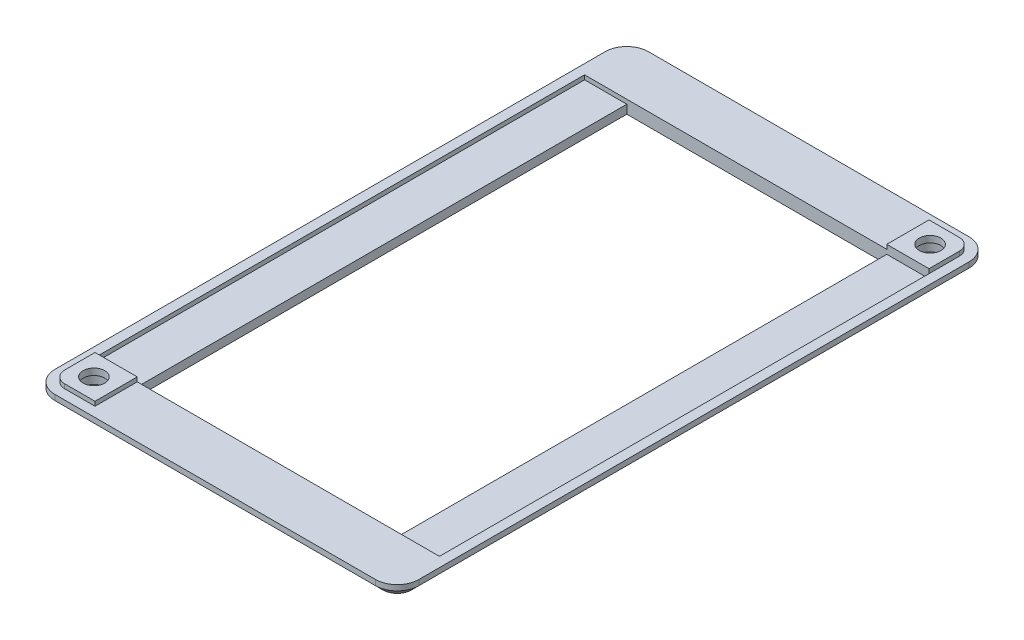
ISO-10303-21;
HEADER;
FILE_DESCRIPTION(('STEP AP214'),'2;1');
FILE_NAME('part.step','',(''),(''),'','','');
FILE_SCHEMA(('AUTOMOTIVE_DESIGN { 1 0 10303 214 1 1 1 1 }'));
ENDSEC;
DATA;
#1=APPLICATION_CONTEXT('core data for automotive mechanical design processes');
#2=APPLICATION_PROTOCOL_DEFINITION('international standard','automotive_design',2000,#1);
#3=PRODUCT_CONTEXT('',#1,'mechanical');
#4=PRODUCT('Part','Part','',(#3));
#5=PRODUCT_RELATED_PRODUCT_CATEGORY('part','',(#4));
#6=PRODUCT_DEFINITION_FORMATION('','',#4);
#7=PRODUCT_DEFINITION_CONTEXT('part definition',#1,'design');
#8=PRODUCT_DEFINITION('design','',#6,#7);
#9=PRODUCT_DEFINITION_SHAPE('','',#8);
#10=(LENGTH_UNIT() NAMED_UNIT(*) SI_UNIT(.MILLI.,.METRE.));
#11=(NAMED_UNIT(*) PLANE_ANGLE_UNIT() SI_UNIT($,.RADIAN.));
#12=(NAMED_UNIT(*) SI_UNIT($,.STERADIAN.) SOLID_ANGLE_UNIT());
#13=UNCERTAINTY_MEASURE_WITH_UNIT(LENGTH_MEASURE(1.E-05),#10,'distance_accuracy_value','');
#14=(GEOMETRIC_REPRESENTATION_CONTEXT(3) GLOBAL_UNCERTAINTY_ASSIGNED_CONTEXT((#13)) GLOBAL_UNIT_ASSIGNED_CONTEXT((#10,
#11,#12)) REPRESENTATION_CONTEXT('',''));
#15=CARTESIAN_POINT('',(0.,0.,0.));
#16=DIRECTION('',(0.,0.,1.));
#17=DIRECTION('',(1.,0.,0.));
#18=AXIS2_PLACEMENT_3D('',#15,#16,#17);
#19=CARTESIAN_POINT('',(0.,3.,0.));
#20=DIRECTION('',(0.,-1.,0.));
#21=DIRECTION('',(0.,0.,-1.));
#22=AXIS2_PLACEMENT_3D('',#19,#20,#21);
#23=PLANE('',#22);
#24=DIRECTION('',(0.,0.,1.));
#25=VECTOR('',#24,1.);
#26=CARTESIAN_POINT('',(2.25,3.,-12.));
#27=LINE('',#26,#25);
#28=CARTESIAN_POINT('',(2.25,3.,-12.));
#29=VERTEX_POINT('',#28);
#30=CARTESIAN_POINT('',(2.25,3.,-5.00000000000002));
#31=VERTEX_POINT('',#30);
#32=EDGE_CURVE('E329',#29,#31,#27,.T.);
#33=ORIENTED_EDGE('',*,*,#32,.F.);
#34=DIRECTION('',(0.,0.,1.));
#35=VECTOR('',#34,1.);
#36=CARTESIAN_POINT('',(2.25,3.,-12.));
#37=LINE('',#36,#35);
#38=CARTESIAN_POINT('',(2.25,3.,-125.));
#39=VERTEX_POINT('',#38);
#40=EDGE_CURVE('E236',#39,#29,#37,.T.);
#41=ORIENTED_EDGE('',*,*,#40,.F.);
#42=DIRECTION('',(-1.,0.,0.));
#43=VECTOR('',#42,1.);
#44=CARTESIAN_POINT('',(12.,3.,-125.));
#45=LINE('',#44,#43);
#46=CARTESIAN_POINT('',(72.,3.,-125.));
#47=VERTEX_POINT('',#46);
#48=EDGE_CURVE('E283',#47,#39,#45,.T.);
#49=ORIENTED_EDGE('',*,*,#48,.F.);
#50=DIRECTION('',(0.,0.,1.));
#51=VECTOR('',#50,1.);
#52=CARTESIAN_POINT('',(72.,3.,-125.));
#53=LINE('',#52,#51);
#54=CARTESIAN_POINT('',(72.,3.,-134.75));
#55=VERTEX_POINT('',#54);
#56=EDGE_CURVE('E380',#55,#47,#53,.T.);
#57=ORIENTED_EDGE('',*,*,#56,.F.);
#58=DIRECTION('',(-1.,0.,0.));
#59=VECTOR('',#58,1.);
#60=CARTESIAN_POINT('',(79.,3.,-134.75));
#61=LINE('',#60,#59);
#62=CARTESIAN_POINT('',(79.,3.,-134.75));
#63=VERTEX_POINT('',#62);
#64=EDGE_CURVE('E377',#63,#55,#61,.T.);
#65=ORIENTED_EDGE('',*,*,#64,.F.);
#66=CARTESIAN_POINT('',(79.,3.,-132.));
#67=DIRECTION('',(0.,1.,0.));
#68=DIRECTION('',(0.,0.,1.));
#69=AXIS2_PLACEMENT_3D('',#66,#67,#68);
#70=CIRCLE('',#69,2.75);
#71=CARTESIAN_POINT('',(81.75,3.,-132.));
#72=VERTEX_POINT('',#71);
#73=EDGE_CURVE('E361',#72,#63,#70,.T.);
#74=ORIENTED_EDGE('',*,*,#73,.F.);
#75=DIRECTION('',(0.,0.,-1.));
#76=VECTOR('',#75,1.);
#77=CARTESIAN_POINT('',(81.75,3.,-125.));
#78=LINE('',#77,#76);
#79=CARTESIAN_POINT('',(81.75,3.,-125.));
#80=VERTEX_POINT('',#79);
#81=EDGE_CURVE('E366',#80,#72,#78,.T.);
#82=ORIENTED_EDGE('',*,*,#81,.F.);
#83=DIRECTION('',(0.,0.,-1.));
#84=VECTOR('',#83,1.);
#85=CARTESIAN_POINT('',(81.75,3.,-12.));
#86=LINE('',#85,#84);
#87=CARTESIAN_POINT('',(81.75,3.,-12.));
#88=VERTEX_POINT('',#87);
#89=EDGE_CURVE('E258',#88,#80,#86,.T.);
#90=ORIENTED_EDGE('',*,*,#89,.F.);
#91=DIRECTION('',(1.,0.,0.));
#92=VECTOR('',#91,1.);
#93=CARTESIAN_POINT('',(12.,3.,-12.));
#94=LINE('',#93,#92);
#95=CARTESIAN_POINT('',(12.,3.,-12.));
#96=VERTEX_POINT('',#95);
#97=EDGE_CURVE('E278',#96,#88,#94,.T.);
#98=ORIENTED_EDGE('',*,*,#97,.F.);
#99=DIRECTION('',(0.,0.,-1.));
#100=VECTOR('',#99,1.);
#101=CARTESIAN_POINT('',(12.,3.,-2.25));
#102=LINE('',#101,#100);
#103=CARTESIAN_POINT('',(12.,3.,-2.25));
#104=VERTEX_POINT('',#103);
#105=EDGE_CURVE('E343',#104,#96,#102,.T.);
#106=ORIENTED_EDGE('',*,*,#105,.F.);
#107=DIRECTION('',(1.,0.,0.));
#108=VECTOR('',#107,1.);
#109=CARTESIAN_POINT('',(5.00000000000002,3.,-2.25));
#110=LINE('',#109,#108);
#111=CARTESIAN_POINT('',(5.00000000000002,3.,-2.25));
#112=VERTEX_POINT('',#111);
#113=EDGE_CURVE('E340',#112,#104,#110,.T.);
#114=ORIENTED_EDGE('',*,*,#113,.F.);
#115=CARTESIAN_POINT('',(5.,3.,-5.));
#116=DIRECTION('',(0.,1.,0.));
#117=DIRECTION('',(0.,0.,1.));
#118=AXIS2_PLACEMENT_3D('',#115,#116,#117);
#119=CIRCLE('',#118,2.75);
#120=EDGE_CURVE('E320',#31,#112,#119,.T.);
#121=ORIENTED_EDGE('',*,*,#120,.F.);
#122=EDGE_LOOP('',(#33,#41,#49,#57,#65,#74,#82,#90,#98,#106,#114,#121));
#123=FACE_BOUND('',#122,.T.);
#124=DIRECTION('',(1.,0.,0.));
#125=VECTOR('',#124,1.);
#126=CARTESIAN_POINT('',(0.,3.,0.));
#127=LINE('',#126,#125);
#128=CARTESIAN_POINT('',(5.,3.,0.));
#129=VERTEX_POINT('',#128);
#130=CARTESIAN_POINT('',(79.,3.,0.));
#131=VERTEX_POINT('',#130);
#132=EDGE_CURVE('E402',#129,#131,#127,.T.);
#133=ORIENTED_EDGE('',*,*,#132,.T.);
#134=CARTESIAN_POINT('',(79.,3.,-5.));
#135=DIRECTION('',(0.,-1.,0.));
#136=DIRECTION('',(0.,0.,-1.));
#137=AXIS2_PLACEMENT_3D('',#134,#135,#136);
#138=CIRCLE('',#137,5.);
#139=CARTESIAN_POINT('',(84.,3.,-5.));
#140=VERTEX_POINT('',#139);
#141=EDGE_CURVE('E426',#131,#140,#138,.F.);
#142=ORIENTED_EDGE('',*,*,#141,.T.);
#143=DIRECTION('',(0.,0.,-1.));
#144=VECTOR('',#143,1.);
#145=CARTESIAN_POINT('',(84.,3.,0.));
#146=LINE('',#145,#144);
#147=CARTESIAN_POINT('',(84.,3.,-132.));
#148=VERTEX_POINT('',#147);
#149=EDGE_CURVE('E405',#140,#148,#146,.T.);
#150=ORIENTED_EDGE('',*,*,#149,.T.);
#151=CARTESIAN_POINT('',(79.,3.,-132.));
#152=DIRECTION('',(0.,-1.,0.));
#153=DIRECTION('',(0.,0.,-1.));
#154=AXIS2_PLACEMENT_3D('',#151,#152,#153);
#155=CIRCLE('',#154,5.);
#156=CARTESIAN_POINT('',(79.,3.,-137.));
#157=VERTEX_POINT('',#156);
#158=EDGE_CURVE('E420',#148,#157,#155,.F.);
#159=ORIENTED_EDGE('',*,*,#158,.T.);
#160=DIRECTION('',(-1.,0.,0.));
#161=VECTOR('',#160,1.);
#162=CARTESIAN_POINT('',(0.,3.,-137.));
#163=LINE('',#162,#161);
#164=CARTESIAN_POINT('',(5.,3.,-137.));
#165=VERTEX_POINT('',#164);
#166=EDGE_CURVE('E408',#157,#165,#163,.T.);
#167=ORIENTED_EDGE('',*,*,#166,.T.);
#168=CARTESIAN_POINT('',(5.,3.,-132.));
#169=DIRECTION('',(0.,-1.,0.));
#170=DIRECTION('',(0.,0.,-1.));
#171=AXIS2_PLACEMENT_3D('',#168,#169,#170);
#172=CIRCLE('',#171,5.);
#173=CARTESIAN_POINT('',(0.,3.,-132.));
#174=VERTEX_POINT('',#173);
#175=EDGE_CURVE('E422',#165,#174,#172,.F.);
#176=ORIENTED_EDGE('',*,*,#175,.T.);
#177=DIRECTION('',(0.,0.,1.));
#178=VECTOR('',#177,1.);
#179=CARTESIAN_POINT('',(0.,3.,0.));
#180=LINE('',#179,#178);
#181=CARTESIAN_POINT('',(0.,3.,-5.));
#182=VERTEX_POINT('',#181);
#183=EDGE_CURVE('E399',#174,#182,#180,.T.);
#184=ORIENTED_EDGE('',*,*,#183,.T.);
#185=CARTESIAN_POINT('',(5.,3.,-5.));
#186=DIRECTION('',(0.,-1.,0.));
#187=DIRECTION('',(0.,0.,-1.));
#188=AXIS2_PLACEMENT_3D('',#185,#186,#187);
#189=CIRCLE('',#188,5.);
#190=EDGE_CURVE('E424',#182,#129,#189,.F.);
#191=ORIENTED_EDGE('',*,*,#190,.T.);
#192=EDGE_LOOP('',(#133,#142,#150,#159,#167,#176,#184,#191));
#193=FACE_BOUND('',#192,.T.);
#194=ADVANCED_FACE('F36',(#123,#193),#23,.F.);
#195=CARTESIAN_POINT('',(0.,3.,0.));
#196=DIRECTION('',(1.,0.,0.));
#197=DIRECTION('',(0.,0.,-1.));
#198=AXIS2_PLACEMENT_3D('',#195,#196,#197);
#199=PLANE('',#198);
#200=DIRECTION('',(0.,-1.,0.));
#201=VECTOR('',#200,1.);
#202=CARTESIAN_POINT('',(0.,3.,-132.));
#203=LINE('',#202,#201);
#204=CARTESIAN_POINT('',(0.,1.74999999999999,-132.));
#205=VERTEX_POINT('',#204);
#206=EDGE_CURVE('E428',#174,#205,#203,.T.);
#207=ORIENTED_EDGE('',*,*,#206,.T.);
#208=DIRECTION('',(0.,0.,1.));
#209=VECTOR('',#208,1.);
#210=CARTESIAN_POINT('',(0.,1.74999999999999,-5.));
#211=LINE('',#210,#209);
#212=CARTESIAN_POINT('',(0.,1.74999999999999,-5.));
#213=VERTEX_POINT('',#212);
#214=EDGE_CURVE('E466',#205,#213,#211,.T.);
#215=ORIENTED_EDGE('',*,*,#214,.T.);
#216=DIRECTION('',(0.,-1.,0.));
#217=VECTOR('',#216,1.);
#218=CARTESIAN_POINT('',(0.,3.,-5.));
#219=LINE('',#218,#217);
#220=EDGE_CURVE('E431',#213,#182,#219,.F.);
#221=ORIENTED_EDGE('',*,*,#220,.T.);
#222=ORIENTED_EDGE('',*,*,#183,.F.);
#223=EDGE_LOOP('',(#207,#215,#221,#222));
#224=FACE_BOUND('',#223,.T.);
#225=ADVANCED_FACE('F534',(#224),#199,.F.);
#226=CARTESIAN_POINT('',(0.,3.,0.));
#227=DIRECTION('',(0.,0.,-1.));
#228=DIRECTION('',(-1.,0.,0.));
#229=AXIS2_PLACEMENT_3D('',#226,#227,#228);
#230=PLANE('',#229);
#231=DIRECTION('',(0.,-1.,0.));
#232=VECTOR('',#231,1.);
#233=CARTESIAN_POINT('',(5.,3.,0.));
#234=LINE('',#233,#232);
#235=CARTESIAN_POINT('',(5.,1.74999999999999,0.));
#236=VERTEX_POINT('',#235);
#237=EDGE_CURVE('E416',#129,#236,#234,.T.);
#238=ORIENTED_EDGE('',*,*,#237,.T.);
#239=DIRECTION('',(1.,0.,0.));
#240=VECTOR('',#239,1.);
#241=CARTESIAN_POINT('',(79.,1.74999999999999,0.));
#242=LINE('',#241,#240);
#243=CARTESIAN_POINT('',(79.,1.74999999999999,0.));
#244=VERTEX_POINT('',#243);
#245=EDGE_CURVE('E11',#236,#244,#242,.T.);
#246=ORIENTED_EDGE('',*,*,#245,.T.);
#247=DIRECTION('',(0.,-1.,0.));
#248=VECTOR('',#247,1.);
#249=CARTESIAN_POINT('',(79.,3.,0.));
#250=LINE('',#249,#248);
#251=EDGE_CURVE('E418',#244,#131,#250,.F.);
#252=ORIENTED_EDGE('',*,*,#251,.T.);
#253=ORIENTED_EDGE('',*,*,#132,.F.);
#254=EDGE_LOOP('',(#238,#246,#252,#253));
#255=FACE_BOUND('',#254,.T.);
#256=ADVANCED_FACE('F559',(#255),#230,.F.);
#257=CARTESIAN_POINT('',(84.,3.,0.));
#258=DIRECTION('',(-1.,0.,0.));
#259=DIRECTION('',(0.,0.,1.));
#260=AXIS2_PLACEMENT_3D('',#257,#258,#259);
#261=PLANE('',#260);
#262=DIRECTION('',(0.,-1.,0.));
#263=VECTOR('',#262,1.);
#264=CARTESIAN_POINT('',(84.,3.,-5.));
#265=LINE('',#264,#263);
#266=CARTESIAN_POINT('',(84.,1.74999999999999,-5.));
#267=VERTEX_POINT('',#266);
#268=EDGE_CURVE('E413',#140,#267,#265,.T.);
#269=ORIENTED_EDGE('',*,*,#268,.T.);
#270=DIRECTION('',(0.,0.,-1.));
#271=VECTOR('',#270,1.);
#272=CARTESIAN_POINT('',(84.,1.74999999999999,-132.));
#273=LINE('',#272,#271);
#274=CARTESIAN_POINT('',(84.,1.74999999999999,-132.));
#275=VERTEX_POINT('',#274);
#276=EDGE_CURVE('E468',#267,#275,#273,.T.);
#277=ORIENTED_EDGE('',*,*,#276,.T.);
#278=DIRECTION('',(0.,-1.,0.));
#279=VECTOR('',#278,1.);
#280=CARTESIAN_POINT('',(84.,3.,-132.));
#281=LINE('',#280,#279);
#282=EDGE_CURVE('E411',#275,#148,#281,.F.);
#283=ORIENTED_EDGE('',*,*,#282,.T.);
#284=ORIENTED_EDGE('',*,*,#149,.F.);
#285=EDGE_LOOP('',(#269,#277,#283,#284));
#286=FACE_BOUND('',#285,.T.);
#287=ADVANCED_FACE('F569',(#286),#261,.F.);
#288=CARTESIAN_POINT('',(0.,3.,-137.));
#289=DIRECTION('',(0.,0.,1.));
#290=DIRECTION('',(1.,0.,0.));
#291=AXIS2_PLACEMENT_3D('',#288,#289,#290);
#292=PLANE('',#291);
#293=DIRECTION('',(0.,-1.,0.));
#294=VECTOR('',#293,1.);
#295=CARTESIAN_POINT('',(79.,3.,-137.));
#296=LINE('',#295,#294);
#297=CARTESIAN_POINT('',(79.,1.74999999999999,-137.));
#298=VERTEX_POINT('',#297);
#299=EDGE_CURVE('E433',#157,#298,#296,.T.);
#300=ORIENTED_EDGE('',*,*,#299,.T.);
#301=DIRECTION('',(-1.,0.,0.));
#302=VECTOR('',#301,1.);
#303=CARTESIAN_POINT('',(5.,1.74999999999999,-137.));
#304=LINE('',#303,#302);
#305=CARTESIAN_POINT('',(5.,1.74999999999999,-137.));
#306=VERTEX_POINT('',#305);
#307=EDGE_CURVE('E438',#298,#306,#304,.T.);
#308=ORIENTED_EDGE('',*,*,#307,.T.);
#309=DIRECTION('',(0.,-1.,0.));
#310=VECTOR('',#309,1.);
#311=CARTESIAN_POINT('',(5.,3.,-137.));
#312=LINE('',#311,#310);
#313=EDGE_CURVE('E436',#306,#165,#312,.F.);
#314=ORIENTED_EDGE('',*,*,#313,.T.);
#315=ORIENTED_EDGE('',*,*,#166,.F.);
#316=EDGE_LOOP('',(#300,#308,#314,#315));
#317=FACE_BOUND('',#316,.T.);
#318=ADVANCED_FACE('F523',(#317),#292,.F.);
#319=CARTESIAN_POINT('',(0.,0.,0.));
#320=DIRECTION('',(0.,-1.,0.));
#321=DIRECTION('',(0.,0.,-1.));
#322=AXIS2_PLACEMENT_3D('',#319,#320,#321);
#323=PLANE('',#322);
#324=CARTESIAN_POINT('',(5.,0.,-132.));
#325=DIRECTION('',(0.,-1.,0.));
#326=DIRECTION('',(0.,0.,-1.));
#327=AXIS2_PLACEMENT_3D('',#324,#325,#326);
#328=CIRCLE('',#327,3.25);
#329=CARTESIAN_POINT('',(1.75,0.,-132.));
#330=VERTEX_POINT('',#329);
#331=CARTESIAN_POINT('',(5.,0.,-135.25));
#332=VERTEX_POINT('',#331);
#333=EDGE_CURVE('E457',#330,#332,#328,.T.);
#334=ORIENTED_EDGE('',*,*,#333,.T.);
#335=DIRECTION('',(1.,0.,0.));
#336=VECTOR('',#335,1.);
#337=CARTESIAN_POINT('',(79.,0.,-135.25));
#338=LINE('',#337,#336);
#339=CARTESIAN_POINT('',(79.,0.,-135.25));
#340=VERTEX_POINT('',#339);
#341=EDGE_CURVE('E459',#332,#340,#338,.T.);
#342=ORIENTED_EDGE('',*,*,#341,.T.);
#343=CARTESIAN_POINT('',(79.,0.,-132.));
#344=DIRECTION('',(0.,-1.,0.));
#345=DIRECTION('',(0.,0.,-1.));
#346=AXIS2_PLACEMENT_3D('',#343,#344,#345);
#347=CIRCLE('',#346,3.25);
#348=CARTESIAN_POINT('',(82.25,0.,-132.));
#349=VERTEX_POINT('',#348);
#350=EDGE_CURVE('E455',#340,#349,#347,.T.);
#351=ORIENTED_EDGE('',*,*,#350,.T.);
#352=DIRECTION('',(0.,0.,1.));
#353=VECTOR('',#352,1.);
#354=CARTESIAN_POINT('',(82.25,0.,-5.));
#355=LINE('',#354,#353);
#356=CARTESIAN_POINT('',(82.25,0.,-5.));
#357=VERTEX_POINT('',#356);
#358=EDGE_CURVE('E451',#349,#357,#355,.T.);
#359=ORIENTED_EDGE('',*,*,#358,.T.);
#360=CARTESIAN_POINT('',(79.,0.,-5.));
#361=DIRECTION('',(0.,-1.,0.));
#362=DIRECTION('',(0.,0.,-1.));
#363=AXIS2_PLACEMENT_3D('',#360,#361,#362);
#364=CIRCLE('',#363,3.25);
#365=CARTESIAN_POINT('',(79.,0.,-1.75));
#366=VERTEX_POINT('',#365);
#367=EDGE_CURVE('E447',#357,#366,#364,.T.);
#368=ORIENTED_EDGE('',*,*,#367,.T.);
#369=DIRECTION('',(-1.,0.,0.));
#370=VECTOR('',#369,1.);
#371=CARTESIAN_POINT('',(5.,0.,-1.75));
#372=LINE('',#371,#370);
#373=CARTESIAN_POINT('',(5.,0.,-1.75));
#374=VERTEX_POINT('',#373);
#375=EDGE_CURVE('E445',#366,#374,#372,.T.);
#376=ORIENTED_EDGE('',*,*,#375,.T.);
#377=CARTESIAN_POINT('',(5.,0.,-5.));
#378=DIRECTION('',(0.,-1.,0.));
#379=DIRECTION('',(0.,0.,-1.));
#380=AXIS2_PLACEMENT_3D('',#377,#378,#379);
#381=CIRCLE('',#380,3.25);
#382=CARTESIAN_POINT('',(1.75,0.,-5.));
#383=VERTEX_POINT('',#382);
#384=EDGE_CURVE('E449',#374,#383,#381,.T.);
#385=ORIENTED_EDGE('',*,*,#384,.T.);
#386=DIRECTION('',(0.,0.,-1.));
#387=VECTOR('',#386,1.);
#388=CARTESIAN_POINT('',(1.75,0.,-132.));
#389=LINE('',#388,#387);
#390=EDGE_CURVE('E453',#383,#330,#389,.T.);
#391=ORIENTED_EDGE('',*,*,#390,.T.);
#392=EDGE_LOOP('',(#334,#342,#351,#359,#368,#376,#385,#391));
#393=FACE_BOUND('',#392,.T.);
#394=DIRECTION('',(0.,0.,1.));
#395=VECTOR('',#394,1.);
#396=CARTESIAN_POINT('',(12.,0.,-12.));
#397=LINE('',#396,#395);
#398=CARTESIAN_POINT('',(12.,0.,-125.));
#399=VERTEX_POINT('',#398);
#400=CARTESIAN_POINT('',(12.,0.,-12.));
#401=VERTEX_POINT('',#400);
#402=EDGE_CURVE('E279',#399,#401,#397,.T.);
#403=ORIENTED_EDGE('',*,*,#402,.T.);
#404=DIRECTION('',(1.,0.,0.));
#405=VECTOR('',#404,1.);
#406=CARTESIAN_POINT('',(12.,0.,-12.));
#407=LINE('',#406,#405);
#408=CARTESIAN_POINT('',(72.,0.,-12.));
#409=VERTEX_POINT('',#408);
#410=EDGE_CURVE('E282',#401,#409,#407,.T.);
#411=ORIENTED_EDGE('',*,*,#410,.T.);
#412=DIRECTION('',(0.,0.,-1.));
#413=VECTOR('',#412,1.);
#414=CARTESIAN_POINT('',(72.,0.,-12.));
#415=LINE('',#414,#413);
#416=CARTESIAN_POINT('',(72.,0.,-125.));
#417=VERTEX_POINT('',#416);
#418=EDGE_CURVE('E286',#409,#417,#415,.T.);
#419=ORIENTED_EDGE('',*,*,#418,.T.);
#420=DIRECTION('',(-1.,0.,0.));
#421=VECTOR('',#420,1.);
#422=CARTESIAN_POINT('',(12.,0.,-125.));
#423=LINE('',#422,#421);
#424=EDGE_CURVE('E289',#417,#399,#423,.T.);
#425=ORIENTED_EDGE('',*,*,#424,.T.);
#426=EDGE_LOOP('',(#403,#411,#419,#425));
#427=FACE_BOUND('',#426,.T.);
#428=CARTESIAN_POINT('',(77.,0.,-130.));
#429=DIRECTION('',(0.,1.,0.));
#430=DIRECTION('',(0.,0.,1.));
#431=AXIS2_PLACEMENT_3D('',#428,#429,#430);
#432=CIRCLE('',#431,3.50000000000001);
#433=CARTESIAN_POINT('',(77.,0.,-126.5));
#434=VERTEX_POINT('',#433);
#435=EDGE_CURVE('E305',#434,#434,#432,.T.);
#436=ORIENTED_EDGE('',*,*,#435,.T.);
#437=EDGE_LOOP('',(#436));
#438=FACE_BOUND('',#437,.T.);
#439=CARTESIAN_POINT('',(7.00000000000002,0.,-6.99999999999999));
#440=DIRECTION('',(0.,1.,0.));
#441=DIRECTION('',(0.,0.,1.));
#442=AXIS2_PLACEMENT_3D('',#439,#440,#441);
#443=CIRCLE('',#442,3.5);
#444=CARTESIAN_POINT('',(7.00000000000002,0.,-3.49999999999999));
#445=VERTEX_POINT('',#444);
#446=EDGE_CURVE('E312',#445,#445,#443,.T.);
#447=ORIENTED_EDGE('',*,*,#446,.T.);
#448=EDGE_LOOP('',(#447));
#449=FACE_BOUND('',#448,.T.);
#450=ADVANCED_FACE('F502',(#393,#427,#438,#449),#323,.T.);
#451=CARTESIAN_POINT('',(79.,4.,-132.));
#452=DIRECTION('',(0.,-1.,0.));
#453=DIRECTION('',(0.,0.,-1.));
#454=AXIS2_PLACEMENT_3D('',#451,#452,#453);
#455=CYLINDRICAL_SURFACE('',#454,2.75);
#456=ORIENTED_EDGE('',*,*,#73,.T.);
#457=DIRECTION('',(0.,-1.,0.));
#458=VECTOR('',#457,1.);
#459=CARTESIAN_POINT('',(79.,4.,-134.75));
#460=LINE('',#459,#458);
#461=CARTESIAN_POINT('',(79.,4.,-134.75));
#462=VERTEX_POINT('',#461);
#463=EDGE_CURVE('E396',#462,#63,#460,.T.);
#464=ORIENTED_EDGE('',*,*,#463,.F.);
#465=CARTESIAN_POINT('',(79.,4.,-132.));
#466=DIRECTION('',(0.,1.,0.));
#467=DIRECTION('',(0.,0.,1.));
#468=AXIS2_PLACEMENT_3D('',#465,#466,#467);
#469=CIRCLE('',#468,2.75);
#470=CARTESIAN_POINT('',(81.75,4.,-132.));
#471=VERTEX_POINT('',#470);
#472=EDGE_CURVE('E362',#471,#462,#469,.T.);
#473=ORIENTED_EDGE('',*,*,#472,.F.);
#474=DIRECTION('',(0.,-1.,0.));
#475=VECTOR('',#474,1.);
#476=CARTESIAN_POINT('',(81.75,4.,-132.));
#477=LINE('',#476,#475);
#478=EDGE_CURVE('E374',#471,#72,#477,.T.);
#479=ORIENTED_EDGE('',*,*,#478,.T.);
#480=EDGE_LOOP('',(#456,#464,#473,#479));
#481=FACE_BOUND('',#480,.T.);
#482=ADVANCED_FACE('F563',(#481),#455,.T.);
#483=CARTESIAN_POINT('',(79.,4.,-134.75));
#484=DIRECTION('',(0.,0.,1.));
#485=DIRECTION('',(1.,0.,0.));
#486=AXIS2_PLACEMENT_3D('',#483,#484,#485);
#487=PLANE('',#486);
#488=ORIENTED_EDGE('',*,*,#64,.T.);
#489=DIRECTION('',(0.,-1.,0.));
#490=VECTOR('',#489,1.);
#491=CARTESIAN_POINT('',(72.,4.,-134.75));
#492=LINE('',#491,#490);
#493=CARTESIAN_POINT('',(72.,4.,-134.75));
#494=VERTEX_POINT('',#493);
#495=EDGE_CURVE('E393',#494,#55,#492,.T.);
#496=ORIENTED_EDGE('',*,*,#495,.F.);
#497=DIRECTION('',(-1.,0.,0.));
#498=VECTOR('',#497,1.);
#499=CARTESIAN_POINT('',(79.,4.,-134.75));
#500=LINE('',#499,#498);
#501=EDGE_CURVE('E365',#462,#494,#500,.T.);
#502=ORIENTED_EDGE('',*,*,#501,.F.);
#503=ORIENTED_EDGE('',*,*,#463,.T.);
#504=EDGE_LOOP('',(#488,#496,#502,#503));
#505=FACE_BOUND('',#504,.T.);
#506=ADVANCED_FACE('F638',(#505),#487,.F.);
#507=CARTESIAN_POINT('',(72.,4.,-125.));
#508=DIRECTION('',(1.,0.,0.));
#509=DIRECTION('',(0.,0.,-1.));
#510=AXIS2_PLACEMENT_3D('',#507,#508,#509);
#511=PLANE('',#510);
#512=ORIENTED_EDGE('',*,*,#56,.T.);
#513=DIRECTION('',(0.,-1.,0.));
#514=VECTOR('',#513,1.);
#515=CARTESIAN_POINT('',(72.,4.,-125.));
#516=LINE('',#515,#514);
#517=CARTESIAN_POINT('',(72.,4.,-125.));
#518=VERTEX_POINT('',#517);
#519=EDGE_CURVE('E390',#518,#47,#516,.T.);
#520=ORIENTED_EDGE('',*,*,#519,.F.);
#521=DIRECTION('',(0.,0.,1.));
#522=VECTOR('',#521,1.);
#523=CARTESIAN_POINT('',(72.,4.,-125.));
#524=LINE('',#523,#522);
#525=EDGE_CURVE('E368',#494,#518,#524,.T.);
#526=ORIENTED_EDGE('',*,*,#525,.F.);
#527=ORIENTED_EDGE('',*,*,#495,.T.);
#528=EDGE_LOOP('',(#512,#520,#526,#527));
#529=FACE_BOUND('',#528,.T.);
#530=ADVANCED_FACE('F635',(#529),#511,.F.);
#531=CARTESIAN_POINT('',(81.75,4.,-125.));
#532=DIRECTION('',(0.,0.,-1.));
#533=DIRECTION('',(-1.,0.,0.));
#534=AXIS2_PLACEMENT_3D('',#531,#532,#533);
#535=PLANE('',#534);
#536=ORIENTED_EDGE('',*,*,#519,.T.);
#537=ORIENTED_EDGE('',*,*,#48,.T.);
#538=DIRECTION('',(0.,1.,0.));
#539=VECTOR('',#538,1.);
#540=CARTESIAN_POINT('',(2.25,2.,-125.));
#541=LINE('',#540,#539);
#542=CARTESIAN_POINT('',(2.25,2.,-125.));
#543=VERTEX_POINT('',#542);
#544=EDGE_CURVE('E267',#543,#39,#541,.T.);
#545=ORIENTED_EDGE('',*,*,#544,.F.);
#546=DIRECTION('',(-1.,0.,0.));
#547=VECTOR('',#546,1.);
#548=CARTESIAN_POINT('',(2.25,2.,-125.));
#549=LINE('',#548,#547);
#550=CARTESIAN_POINT('',(12.,2.,-125.));
#551=VERTEX_POINT('',#550);
#552=EDGE_CURVE('E256',#551,#543,#549,.T.);
#553=ORIENTED_EDGE('',*,*,#552,.F.);
#554=DIRECTION('',(0.,1.,0.));
#555=VECTOR('',#554,1.);
#556=CARTESIAN_POINT('',(12.,0.,-125.));
#557=LINE('',#556,#555);
#558=EDGE_CURVE('E294',#399,#551,#557,.T.);
#559=ORIENTED_EDGE('',*,*,#558,.F.);
#560=ORIENTED_EDGE('',*,*,#424,.F.);
#561=DIRECTION('',(0.,1.,0.));
#562=VECTOR('',#561,1.);
#563=CARTESIAN_POINT('',(72.,0.,-125.));
#564=LINE('',#563,#562);
#565=CARTESIAN_POINT('',(72.,2.,-125.));
#566=VERTEX_POINT('',#565);
#567=EDGE_CURVE('E298',#417,#566,#564,.T.);
#568=ORIENTED_EDGE('',*,*,#567,.T.);
#569=CARTESIAN_POINT('',(81.75,2.,-125.));
#570=VERTEX_POINT('',#569);
#571=EDGE_CURVE('E241',#570,#566,#549,.T.);
#572=ORIENTED_EDGE('',*,*,#571,.F.);
#573=DIRECTION('',(0.,1.,0.));
#574=VECTOR('',#573,1.);
#575=CARTESIAN_POINT('',(81.75,2.,-125.));
#576=LINE('',#575,#574);
#577=EDGE_CURVE('E270',#570,#80,#576,.T.);
#578=ORIENTED_EDGE('',*,*,#577,.T.);
#579=DIRECTION('',(0.,-1.,0.));
#580=VECTOR('',#579,1.);
#581=CARTESIAN_POINT('',(81.75,4.,-125.));
#582=LINE('',#581,#580);
#583=CARTESIAN_POINT('',(81.75,4.,-125.));
#584=VERTEX_POINT('',#583);
#585=EDGE_CURVE('E387',#584,#80,#582,.T.);
#586=ORIENTED_EDGE('',*,*,#585,.F.);
#587=DIRECTION('',(1.,0.,0.));
#588=VECTOR('',#587,1.);
#589=CARTESIAN_POINT('',(81.75,4.,-125.));
#590=LINE('',#589,#588);
#591=EDGE_CURVE('E370',#518,#584,#590,.T.);
#592=ORIENTED_EDGE('',*,*,#591,.F.);
#593=EDGE_LOOP('',(#536,#537,#545,#553,#559,#560,#568,#572,#578,#586,#592));
#594=FACE_BOUND('',#593,.T.);
#595=ADVANCED_FACE('F631',(#594),#535,.F.);
#596=CARTESIAN_POINT('',(81.75,4.,-125.));
#597=DIRECTION('',(-1.,0.,0.));
#598=DIRECTION('',(0.,0.,1.));
#599=AXIS2_PLACEMENT_3D('',#596,#597,#598);
#600=PLANE('',#599);
#601=ORIENTED_EDGE('',*,*,#81,.T.);
#602=ORIENTED_EDGE('',*,*,#478,.F.);
#603=DIRECTION('',(0.,0.,-1.));
#604=VECTOR('',#603,1.);
#605=CARTESIAN_POINT('',(81.75,4.,-125.));
#606=LINE('',#605,#604);
#607=EDGE_CURVE('E372',#584,#471,#606,.T.);
#608=ORIENTED_EDGE('',*,*,#607,.F.);
#609=ORIENTED_EDGE('',*,*,#585,.T.);
#610=EDGE_LOOP('',(#601,#602,#608,#609));
#611=FACE_BOUND('',#610,.T.);
#612=ADVANCED_FACE('F627',(#611),#600,.F.);
#613=CARTESIAN_POINT('',(79.,4.,-132.));
#614=DIRECTION('',(0.,1.,0.));
#615=DIRECTION('',(0.,0.,1.));
#616=AXIS2_PLACEMENT_3D('',#613,#614,#615);
#617=PLANE('',#616);
#618=CARTESIAN_POINT('',(77.,4.,-130.));
#619=DIRECTION('',(0.,1.,0.));
#620=DIRECTION('',(0.,0.,1.));
#621=AXIS2_PLACEMENT_3D('',#618,#619,#620);
#622=CIRCLE('',#621,2.5);
#623=CARTESIAN_POINT('',(77.,4.,-127.5));
#624=VERTEX_POINT('',#623);
#625=EDGE_CURVE('E321',#624,#624,#622,.T.);
#626=ORIENTED_EDGE('',*,*,#625,.F.);
#627=EDGE_LOOP('',(#626));
#628=FACE_BOUND('',#627,.T.);
#629=ORIENTED_EDGE('',*,*,#472,.T.);
#630=ORIENTED_EDGE('',*,*,#501,.T.);
#631=ORIENTED_EDGE('',*,*,#525,.T.);
#632=ORIENTED_EDGE('',*,*,#591,.T.);
#633=ORIENTED_EDGE('',*,*,#607,.T.);
#634=EDGE_LOOP('',(#629,#630,#631,#632,#633));
#635=FACE_BOUND('',#634,.T.);
#636=ADVANCED_FACE('F623',(#628,#635),#617,.T.);
#637=CARTESIAN_POINT('',(5.,4.,-5.));
#638=DIRECTION('',(0.,-1.,0.));
#639=DIRECTION('',(0.,0.,-1.));
#640=AXIS2_PLACEMENT_3D('',#637,#638,#639);
#641=CYLINDRICAL_SURFACE('',#640,2.75);
#642=ORIENTED_EDGE('',*,*,#120,.T.);
#643=DIRECTION('',(0.,-1.,0.));
#644=VECTOR('',#643,1.);
#645=CARTESIAN_POINT('',(5.00000000000002,4.,-2.25));
#646=LINE('',#645,#644);
#647=CARTESIAN_POINT('',(5.00000000000002,4.,-2.25));
#648=VERTEX_POINT('',#647);
#649=EDGE_CURVE('E358',#648,#112,#646,.T.);
#650=ORIENTED_EDGE('',*,*,#649,.F.);
#651=CARTESIAN_POINT('',(5.,4.,-5.));
#652=DIRECTION('',(0.,1.,0.));
#653=DIRECTION('',(0.,0.,1.));
#654=AXIS2_PLACEMENT_3D('',#651,#652,#653);
#655=CIRCLE('',#654,2.75);
#656=CARTESIAN_POINT('',(2.25,4.,-5.00000000000002));
#657=VERTEX_POINT('',#656);
#658=EDGE_CURVE('E325',#657,#648,#655,.T.);
#659=ORIENTED_EDGE('',*,*,#658,.F.);
#660=DIRECTION('',(0.,-1.,0.));
#661=VECTOR('',#660,1.);
#662=CARTESIAN_POINT('',(2.25,4.,-5.00000000000002));
#663=LINE('',#662,#661);
#664=EDGE_CURVE('E337',#657,#31,#663,.T.);
#665=ORIENTED_EDGE('',*,*,#664,.T.);
#666=EDGE_LOOP('',(#642,#650,#659,#665));
#667=FACE_BOUND('',#666,.T.);
#668=ADVANCED_FACE('F619',(#667),#641,.T.);
#669=CARTESIAN_POINT('',(5.00000000000002,4.,-2.25));
#670=DIRECTION('',(0.,0.,-1.));
#671=DIRECTION('',(-1.,0.,0.));
#672=AXIS2_PLACEMENT_3D('',#669,#670,#671);
#673=PLANE('',#672);
#674=ORIENTED_EDGE('',*,*,#113,.T.);
#675=DIRECTION('',(0.,-1.,0.));
#676=VECTOR('',#675,1.);
#677=CARTESIAN_POINT('',(12.,4.,-2.25));
#678=LINE('',#677,#676);
#679=CARTESIAN_POINT('',(12.,4.,-2.25));
#680=VERTEX_POINT('',#679);
#681=EDGE_CURVE('E355',#680,#104,#678,.T.);
#682=ORIENTED_EDGE('',*,*,#681,.F.);
#683=DIRECTION('',(1.,0.,0.));
#684=VECTOR('',#683,1.);
#685=CARTESIAN_POINT('',(5.00000000000002,4.,-2.25));
#686=LINE('',#685,#684);
#687=EDGE_CURVE('E328',#648,#680,#686,.T.);
#688=ORIENTED_EDGE('',*,*,#687,.F.);
#689=ORIENTED_EDGE('',*,*,#649,.T.);
#690=EDGE_LOOP('',(#674,#682,#688,#689));
#691=FACE_BOUND('',#690,.T.);
#692=ADVANCED_FACE('F615',(#691),#673,.F.);
#693=CARTESIAN_POINT('',(12.,4.,-2.25));
#694=DIRECTION('',(-1.,0.,0.));
#695=DIRECTION('',(0.,0.,1.));
#696=AXIS2_PLACEMENT_3D('',#693,#694,#695);
#697=PLANE('',#696);
#698=ORIENTED_EDGE('',*,*,#105,.T.);
#699=DIRECTION('',(0.,-1.,0.));
#700=VECTOR('',#699,1.);
#701=CARTESIAN_POINT('',(12.,4.,-12.));
#702=LINE('',#701,#700);
#703=CARTESIAN_POINT('',(12.,4.,-12.));
#704=VERTEX_POINT('',#703);
#705=EDGE_CURVE('E353',#704,#96,#702,.T.);
#706=ORIENTED_EDGE('',*,*,#705,.F.);
#707=DIRECTION('',(0.,0.,-1.));
#708=VECTOR('',#707,1.);
#709=CARTESIAN_POINT('',(12.,4.,-2.25));
#710=LINE('',#709,#708);
#711=EDGE_CURVE('E331',#680,#704,#710,.T.);
#712=ORIENTED_EDGE('',*,*,#711,.F.);
#713=ORIENTED_EDGE('',*,*,#681,.T.);
#714=EDGE_LOOP('',(#698,#706,#712,#713));
#715=FACE_BOUND('',#714,.T.);
#716=ADVANCED_FACE('F612',(#715),#697,.F.);
#717=CARTESIAN_POINT('',(12.,4.,-12.));
#718=DIRECTION('',(0.,0.,1.));
#719=DIRECTION('',(1.,0.,0.));
#720=AXIS2_PLACEMENT_3D('',#717,#718,#719);
#721=PLANE('',#720);
#722=ORIENTED_EDGE('',*,*,#705,.T.);
#723=ORIENTED_EDGE('',*,*,#97,.T.);
#724=DIRECTION('',(0.,1.,0.));
#725=VECTOR('',#724,1.);
#726=CARTESIAN_POINT('',(81.75,2.,-12.));
#727=LINE('',#726,#725);
#728=CARTESIAN_POINT('',(81.75,2.,-12.));
#729=VERTEX_POINT('',#728);
#730=EDGE_CURVE('E240',#729,#88,#727,.T.);
#731=ORIENTED_EDGE('',*,*,#730,.F.);
#732=DIRECTION('',(1.,0.,0.));
#733=VECTOR('',#732,1.);
#734=CARTESIAN_POINT('',(2.25,2.,-12.));
#735=LINE('',#734,#733);
#736=CARTESIAN_POINT('',(72.,2.,-12.));
#737=VERTEX_POINT('',#736);
#738=EDGE_CURVE('E252',#737,#729,#735,.T.);
#739=ORIENTED_EDGE('',*,*,#738,.F.);
#740=DIRECTION('',(0.,1.,0.));
#741=VECTOR('',#740,1.);
#742=CARTESIAN_POINT('',(72.,0.,-12.));
#743=LINE('',#742,#741);
#744=EDGE_CURVE('E301',#409,#737,#743,.T.);
#745=ORIENTED_EDGE('',*,*,#744,.F.);
#746=ORIENTED_EDGE('',*,*,#410,.F.);
#747=DIRECTION('',(0.,1.,0.));
#748=VECTOR('',#747,1.);
#749=CARTESIAN_POINT('',(12.,0.,-12.));
#750=LINE('',#749,#748);
#751=CARTESIAN_POINT('',(12.,2.,-12.));
#752=VERTEX_POINT('',#751);
#753=EDGE_CURVE('E248',#401,#752,#750,.T.);
#754=ORIENTED_EDGE('',*,*,#753,.T.);
#755=CARTESIAN_POINT('',(2.25,2.,-12.));
#756=VERTEX_POINT('',#755);
#757=EDGE_CURVE('E244',#756,#752,#735,.T.);
#758=ORIENTED_EDGE('',*,*,#757,.F.);
#759=DIRECTION('',(0.,1.,0.));
#760=VECTOR('',#759,1.);
#761=CARTESIAN_POINT('',(2.25,2.,-12.));
#762=LINE('',#761,#760);
#763=EDGE_CURVE('E229',#756,#29,#762,.T.);
#764=ORIENTED_EDGE('',*,*,#763,.T.);
#765=DIRECTION('',(0.,-1.,0.));
#766=VECTOR('',#765,1.);
#767=CARTESIAN_POINT('',(2.25,4.,-12.));
#768=LINE('',#767,#766);
#769=CARTESIAN_POINT('',(2.25,4.,-12.));
#770=VERTEX_POINT('',#769);
#771=EDGE_CURVE('E350',#770,#29,#768,.T.);
#772=ORIENTED_EDGE('',*,*,#771,.F.);
#773=DIRECTION('',(-1.,0.,0.));
#774=VECTOR('',#773,1.);
#775=CARTESIAN_POINT('',(12.,4.,-12.));
#776=LINE('',#775,#774);
#777=EDGE_CURVE('E333',#704,#770,#776,.T.);
#778=ORIENTED_EDGE('',*,*,#777,.F.);
#779=EDGE_LOOP('',(#722,#723,#731,#739,#745,#746,#754,#758,#764,#772,#778));
#780=FACE_BOUND('',#779,.T.);
#781=ADVANCED_FACE('F246',(#780),#721,.F.);
#782=CARTESIAN_POINT('',(2.25,4.,-12.));
#783=DIRECTION('',(1.,0.,0.));
#784=DIRECTION('',(0.,0.,-1.));
#785=AXIS2_PLACEMENT_3D('',#782,#783,#784);
#786=PLANE('',#785);
#787=ORIENTED_EDGE('',*,*,#32,.T.);
#788=ORIENTED_EDGE('',*,*,#664,.F.);
#789=DIRECTION('',(0.,0.,1.));
#790=VECTOR('',#789,1.);
#791=CARTESIAN_POINT('',(2.25,4.,-12.));
#792=LINE('',#791,#790);
#793=EDGE_CURVE('E335',#770,#657,#792,.T.);
#794=ORIENTED_EDGE('',*,*,#793,.F.);
#795=ORIENTED_EDGE('',*,*,#771,.T.);
#796=EDGE_LOOP('',(#787,#788,#794,#795));
#797=FACE_BOUND('',#796,.T.);
#798=ADVANCED_FACE('F605',(#797),#786,.F.);
#799=CARTESIAN_POINT('',(5.,4.,-5.));
#800=DIRECTION('',(0.,1.,0.));
#801=DIRECTION('',(0.,0.,1.));
#802=AXIS2_PLACEMENT_3D('',#799,#800,#801);
#803=PLANE('',#802);
#804=CARTESIAN_POINT('',(7.00000000000002,4.,-6.99999999999999));
#805=DIRECTION('',(0.,1.,0.));
#806=DIRECTION('',(0.,0.,1.));
#807=AXIS2_PLACEMENT_3D('',#804,#805,#806);
#808=CIRCLE('',#807,2.5);
#809=CARTESIAN_POINT('',(7.00000000000002,4.,-4.49999999999999));
#810=VERTEX_POINT('',#809);
#811=EDGE_CURVE('E317',#810,#810,#808,.T.);
#812=ORIENTED_EDGE('',*,*,#811,.F.);
#813=EDGE_LOOP('',(#812));
#814=FACE_BOUND('',#813,.T.);
#815=ORIENTED_EDGE('',*,*,#658,.T.);
#816=ORIENTED_EDGE('',*,*,#687,.T.);
#817=ORIENTED_EDGE('',*,*,#711,.T.);
#818=ORIENTED_EDGE('',*,*,#777,.T.);
#819=ORIENTED_EDGE('',*,*,#793,.T.);
#820=EDGE_LOOP('',(#815,#816,#817,#818,#819));
#821=FACE_BOUND('',#820,.T.);
#822=ADVANCED_FACE('F579',(#814,#821),#803,.T.);
#823=CARTESIAN_POINT('',(79.,3.,-5.));
#824=DIRECTION('',(0.,-1.,0.));
#825=DIRECTION('',(0.,0.,-1.));
#826=AXIS2_PLACEMENT_3D('',#823,#824,#825);
#827=CYLINDRICAL_SURFACE('',#826,5.);
#828=ORIENTED_EDGE('',*,*,#251,.F.);
#829=CARTESIAN_POINT('',(79.,1.74999999999999,-5.));
#830=DIRECTION('',(0.,-1.,0.));
#831=DIRECTION('',(0.,0.,-1.));
#832=AXIS2_PLACEMENT_3D('',#829,#830,#831);
#833=CIRCLE('',#832,5.);
#834=EDGE_CURVE('E45',#244,#267,#833,.F.);
#835=ORIENTED_EDGE('',*,*,#834,.T.);
#836=ORIENTED_EDGE('',*,*,#268,.F.);
#837=ORIENTED_EDGE('',*,*,#141,.F.);
#838=EDGE_LOOP('',(#828,#835,#836,#837));
#839=FACE_BOUND('',#838,.T.);
#840=ADVANCED_FACE('F575',(#839),#827,.T.);
#841=CARTESIAN_POINT('',(5.,3.,-5.));
#842=DIRECTION('',(0.,-1.,0.));
#843=DIRECTION('',(0.,0.,-1.));
#844=AXIS2_PLACEMENT_3D('',#841,#842,#843);
#845=CYLINDRICAL_SURFACE('',#844,5.);
#846=ORIENTED_EDGE('',*,*,#220,.F.);
#847=CARTESIAN_POINT('',(5.,1.74999999999999,-5.));
#848=DIRECTION('',(0.,-1.,0.));
#849=DIRECTION('',(0.,0.,-1.));
#850=AXIS2_PLACEMENT_3D('',#847,#848,#849);
#851=CIRCLE('',#850,5.);
#852=EDGE_CURVE('E59',#213,#236,#851,.F.);
#853=ORIENTED_EDGE('',*,*,#852,.T.);
#854=ORIENTED_EDGE('',*,*,#237,.F.);
#855=ORIENTED_EDGE('',*,*,#190,.F.);
#856=EDGE_LOOP('',(#846,#853,#854,#855));
#857=FACE_BOUND('',#856,.T.);
#858=ADVANCED_FACE('F578',(#857),#845,.T.);
#859=CARTESIAN_POINT('',(5.,3.,-132.));
#860=DIRECTION('',(0.,-1.,0.));
#861=DIRECTION('',(0.,0.,-1.));
#862=AXIS2_PLACEMENT_3D('',#859,#860,#861);
#863=CYLINDRICAL_SURFACE('',#862,5.);
#864=ORIENTED_EDGE('',*,*,#313,.F.);
#865=CARTESIAN_POINT('',(5.,1.74999999999999,-132.));
#866=DIRECTION('',(0.,-1.,0.));
#867=DIRECTION('',(0.,0.,-1.));
#868=AXIS2_PLACEMENT_3D('',#865,#866,#867);
#869=CIRCLE('',#868,5.);
#870=EDGE_CURVE('E462',#306,#205,#869,.F.);
#871=ORIENTED_EDGE('',*,*,#870,.T.);
#872=ORIENTED_EDGE('',*,*,#206,.F.);
#873=ORIENTED_EDGE('',*,*,#175,.F.);
#874=EDGE_LOOP('',(#864,#871,#872,#873));
#875=FACE_BOUND('',#874,.T.);
#876=ADVANCED_FACE('F530',(#875),#863,.T.);
#877=CARTESIAN_POINT('',(79.,3.,-132.));
#878=DIRECTION('',(0.,-1.,0.));
#879=DIRECTION('',(0.,0.,-1.));
#880=AXIS2_PLACEMENT_3D('',#877,#878,#879);
#881=CYLINDRICAL_SURFACE('',#880,5.);
#882=ORIENTED_EDGE('',*,*,#282,.F.);
#883=CARTESIAN_POINT('',(79.,1.74999999999999,-132.));
#884=DIRECTION('',(0.,-1.,0.));
#885=DIRECTION('',(0.,0.,-1.));
#886=AXIS2_PLACEMENT_3D('',#883,#884,#885);
#887=CIRCLE('',#886,5.);
#888=EDGE_CURVE('E464',#275,#298,#887,.F.);
#889=ORIENTED_EDGE('',*,*,#888,.T.);
#890=ORIENTED_EDGE('',*,*,#299,.F.);
#891=ORIENTED_EDGE('',*,*,#158,.F.);
#892=EDGE_LOOP('',(#882,#889,#890,#891));
#893=FACE_BOUND('',#892,.T.);
#894=ADVANCED_FACE('F519',(#893),#881,.T.);
#895=CARTESIAN_POINT('',(7.00000000000002,0.,-6.99999999999999));
#896=DIRECTION('',(0.,1.,0.));
#897=DIRECTION('',(0.,0.,1.));
#898=AXIS2_PLACEMENT_3D('',#895,#896,#897);
#899=CYLINDRICAL_SURFACE('',#898,2.5);
#900=CARTESIAN_POINT('',(7.00000000000002,2.5,-6.99999999999999));
#901=DIRECTION('',(0.,1.,0.));
#902=DIRECTION('',(0.,0.,1.));
#903=AXIS2_PLACEMENT_3D('',#900,#901,#902);
#904=CIRCLE('',#903,2.5);
#905=CARTESIAN_POINT('',(7.00000000000002,2.5,-4.49999999999999));
#906=VERTEX_POINT('',#905);
#907=EDGE_CURVE('E324',#906,#906,#904,.F.);
#908=ORIENTED_EDGE('',*,*,#907,.T.);
#909=EDGE_LOOP('',(#908));
#910=FACE_BOUND('',#909,.T.);
#911=ORIENTED_EDGE('',*,*,#811,.T.);
#912=EDGE_LOOP('',(#911));
#913=FACE_BOUND('',#912,.T.);
#914=ADVANCED_FACE('F585',(#910,#913),#899,.F.);
#915=CARTESIAN_POINT('',(77.,0.,-130.));
#916=DIRECTION('',(0.,1.,0.));
#917=DIRECTION('',(0.,0.,1.));
#918=AXIS2_PLACEMENT_3D('',#915,#916,#917);
#919=CYLINDRICAL_SURFACE('',#918,2.5);
#920=CARTESIAN_POINT('',(77.,2.5,-130.));
#921=DIRECTION('',(0.,1.,0.));
#922=DIRECTION('',(0.,0.,1.));
#923=AXIS2_PLACEMENT_3D('',#920,#921,#922);
#924=CIRCLE('',#923,2.5);
#925=CARTESIAN_POINT('',(77.,2.5,-127.5));
#926=VERTEX_POINT('',#925);
#927=EDGE_CURVE('E308',#926,#926,#924,.F.);
#928=ORIENTED_EDGE('',*,*,#927,.T.);
#929=EDGE_LOOP('',(#928));
#930=FACE_BOUND('',#929,.T.);
#931=ORIENTED_EDGE('',*,*,#625,.T.);
#932=EDGE_LOOP('',(#931));
#933=FACE_BOUND('',#932,.T.);
#934=ADVANCED_FACE('F589',(#930,#933),#919,.F.);
#935=CARTESIAN_POINT('',(77.,2.5,-130.));
#936=DIRECTION('',(0.,1.,0.));
#937=DIRECTION('',(0.,0.,1.));
#938=AXIS2_PLACEMENT_3D('',#935,#936,#937);
#939=PLANE('',#938);
#940=CARTESIAN_POINT('',(77.,2.5,-130.));
#941=DIRECTION('',(0.,1.,0.));
#942=DIRECTION('',(0.,0.,1.));
#943=AXIS2_PLACEMENT_3D('',#940,#941,#942);
#944=CIRCLE('',#943,3.50000000000001);
#945=CARTESIAN_POINT('',(77.,2.5,-126.5));
#946=VERTEX_POINT('',#945);
#947=EDGE_CURVE('E309',#946,#946,#944,.T.);
#948=ORIENTED_EDGE('',*,*,#947,.F.);
#949=EDGE_LOOP('',(#948));
#950=FACE_BOUND('',#949,.T.);
#951=ORIENTED_EDGE('',*,*,#927,.F.);
#952=EDGE_LOOP('',(#951));
#953=FACE_BOUND('',#952,.T.);
#954=ADVANCED_FACE('F595',(#950,#953),#939,.F.);
#955=CARTESIAN_POINT('',(77.,0.,-130.));
#956=DIRECTION('',(0.,1.,0.));
#957=DIRECTION('',(0.,0.,1.));
#958=AXIS2_PLACEMENT_3D('',#955,#956,#957);
#959=CYLINDRICAL_SURFACE('',#958,3.50000000000001);
#960=ORIENTED_EDGE('',*,*,#435,.F.);
#961=EDGE_LOOP('',(#960));
#962=FACE_BOUND('',#961,.T.);
#963=ORIENTED_EDGE('',*,*,#947,.T.);
#964=EDGE_LOOP('',(#963));
#965=FACE_BOUND('',#964,.T.);
#966=ADVANCED_FACE('F704',(#962,#965),#959,.F.);
#967=CARTESIAN_POINT('',(7.00000000000002,2.5,-6.99999999999999));
#968=DIRECTION('',(0.,1.,0.));
#969=DIRECTION('',(0.,0.,1.));
#970=AXIS2_PLACEMENT_3D('',#967,#968,#969);
#971=PLANE('',#970);
#972=CARTESIAN_POINT('',(7.00000000000002,2.5,-6.99999999999999));
#973=DIRECTION('',(0.,1.,0.));
#974=DIRECTION('',(0.,0.,1.));
#975=AXIS2_PLACEMENT_3D('',#972,#973,#974);
#976=CIRCLE('',#975,3.5);
#977=CARTESIAN_POINT('',(7.00000000000002,2.5,-3.49999999999999));
#978=VERTEX_POINT('',#977);
#979=EDGE_CURVE('E297',#978,#978,#976,.T.);
#980=ORIENTED_EDGE('',*,*,#979,.F.);
#981=EDGE_LOOP('',(#980));
#982=FACE_BOUND('',#981,.T.);
#983=ORIENTED_EDGE('',*,*,#907,.F.);
#984=EDGE_LOOP('',(#983));
#985=FACE_BOUND('',#984,.T.);
#986=ADVANCED_FACE('F707',(#982,#985),#971,.F.);
#987=CARTESIAN_POINT('',(7.00000000000002,0.,-6.99999999999999));
#988=DIRECTION('',(0.,1.,0.));
#989=DIRECTION('',(0.,0.,1.));
#990=AXIS2_PLACEMENT_3D('',#987,#988,#989);
#991=CYLINDRICAL_SURFACE('',#990,3.5);
#992=ORIENTED_EDGE('',*,*,#446,.F.);
#993=EDGE_LOOP('',(#992));
#994=FACE_BOUND('',#993,.T.);
#995=ORIENTED_EDGE('',*,*,#979,.T.);
#996=EDGE_LOOP('',(#995));
#997=FACE_BOUND('',#996,.T.);
#998=ADVANCED_FACE('F600',(#994,#997),#991,.F.);
#999=CARTESIAN_POINT('',(12.,0.,-12.));
#1000=DIRECTION('',(-1.,0.,0.));
#1001=DIRECTION('',(0.,0.,1.));
#1002=AXIS2_PLACEMENT_3D('',#999,#1000,#1001);
#1003=PLANE('',#1002);
#1004=ORIENTED_EDGE('',*,*,#558,.T.);
#1005=DIRECTION('',(0.,0.,1.));
#1006=VECTOR('',#1005,1.);
#1007=CARTESIAN_POINT('',(12.,2.,-12.));
#1008=LINE('',#1007,#1006);
#1009=EDGE_CURVE('E276',#551,#752,#1008,.T.);
#1010=ORIENTED_EDGE('',*,*,#1009,.T.);
#1011=ORIENTED_EDGE('',*,*,#753,.F.);
#1012=ORIENTED_EDGE('',*,*,#402,.F.);
#1013=EDGE_LOOP('',(#1004,#1010,#1011,#1012));
#1014=FACE_BOUND('',#1013,.T.);
#1015=ADVANCED_FACE('F675',(#1014),#1003,.F.);
#1016=CARTESIAN_POINT('',(72.,0.,-12.));
#1017=DIRECTION('',(1.,0.,0.));
#1018=DIRECTION('',(0.,0.,-1.));
#1019=AXIS2_PLACEMENT_3D('',#1016,#1017,#1018);
#1020=PLANE('',#1019);
#1021=ORIENTED_EDGE('',*,*,#744,.T.);
#1022=DIRECTION('',(0.,0.,-1.));
#1023=VECTOR('',#1022,1.);
#1024=CARTESIAN_POINT('',(72.,2.,-12.));
#1025=LINE('',#1024,#1023);
#1026=EDGE_CURVE('E269',#737,#566,#1025,.T.);
#1027=ORIENTED_EDGE('',*,*,#1026,.T.);
#1028=ORIENTED_EDGE('',*,*,#567,.F.);
#1029=ORIENTED_EDGE('',*,*,#418,.F.);
#1030=EDGE_LOOP('',(#1021,#1027,#1028,#1029));
#1031=FACE_BOUND('',#1030,.T.);
#1032=ADVANCED_FACE('F678',(#1031),#1020,.F.);
#1033=CARTESIAN_POINT('',(0.,2.,0.));
#1034=DIRECTION('',(0.,-1.,0.));
#1035=DIRECTION('',(0.,0.,-1.));
#1036=AXIS2_PLACEMENT_3D('',#1033,#1034,#1035);
#1037=PLANE('',#1036);
#1038=ORIENTED_EDGE('',*,*,#738,.T.);
#1039=DIRECTION('',(0.,0.,-1.));
#1040=VECTOR('',#1039,1.);
#1041=CARTESIAN_POINT('',(81.75,2.,-12.));
#1042=LINE('',#1041,#1040);
#1043=EDGE_CURVE('E251',#729,#570,#1042,.T.);
#1044=ORIENTED_EDGE('',*,*,#1043,.T.);
#1045=ORIENTED_EDGE('',*,*,#571,.T.);
#1046=ORIENTED_EDGE('',*,*,#1026,.F.);
#1047=EDGE_LOOP('',(#1038,#1044,#1045,#1046));
#1048=FACE_BOUND('',#1047,.T.);
#1049=ADVANCED_FACE('F682',(#1048),#1037,.F.);
#1050=CARTESIAN_POINT('',(81.75,2.,-12.));
#1051=DIRECTION('',(1.,0.,0.));
#1052=DIRECTION('',(0.,0.,-1.));
#1053=AXIS2_PLACEMENT_3D('',#1050,#1051,#1052);
#1054=PLANE('',#1053);
#1055=ORIENTED_EDGE('',*,*,#89,.T.);
#1056=ORIENTED_EDGE('',*,*,#577,.F.);
#1057=ORIENTED_EDGE('',*,*,#1043,.F.);
#1058=ORIENTED_EDGE('',*,*,#730,.T.);
#1059=EDGE_LOOP('',(#1055,#1056,#1057,#1058));
#1060=FACE_BOUND('',#1059,.T.);
#1061=ADVANCED_FACE('F661',(#1060),#1054,.F.);
#1062=ORIENTED_EDGE('',*,*,#552,.T.);
#1063=DIRECTION('',(0.,0.,1.));
#1064=VECTOR('',#1063,1.);
#1065=CARTESIAN_POINT('',(2.25,2.,-12.));
#1066=LINE('',#1065,#1064);
#1067=EDGE_CURVE('E234',#543,#756,#1066,.T.);
#1068=ORIENTED_EDGE('',*,*,#1067,.T.);
#1069=ORIENTED_EDGE('',*,*,#757,.T.);
#1070=ORIENTED_EDGE('',*,*,#1009,.F.);
#1071=EDGE_LOOP('',(#1062,#1068,#1069,#1070));
#1072=FACE_BOUND('',#1071,.T.);
#1073=ADVANCED_FACE('F254',(#1072),#1037,.F.);
#1074=CARTESIAN_POINT('',(2.25,2.,-12.));
#1075=DIRECTION('',(-1.,0.,0.));
#1076=DIRECTION('',(0.,0.,1.));
#1077=AXIS2_PLACEMENT_3D('',#1074,#1075,#1076);
#1078=PLANE('',#1077);
#1079=ORIENTED_EDGE('',*,*,#40,.T.);
#1080=ORIENTED_EDGE('',*,*,#763,.F.);
#1081=ORIENTED_EDGE('',*,*,#1067,.F.);
#1082=ORIENTED_EDGE('',*,*,#544,.T.);
#1083=EDGE_LOOP('',(#1079,#1080,#1081,#1082));
#1084=FACE_BOUND('',#1083,.T.);
#1085=ADVANCED_FACE('F231',(#1084),#1078,.F.);
#1086=CARTESIAN_POINT('',(0.,1.74999999999999,0.));
#1087=DIRECTION('',(0.,-0.70710678118655,0.707106781186545));
#1088=DIRECTION('',(-1.,0.,0.));
#1089=AXIS2_PLACEMENT_3D('',#1086,#1087,#1088);
#1090=PLANE('',#1089);
#1091=DIRECTION('',(0.,0.707106781186545,0.70710678118655));
#1092=VECTOR('',#1091,1.);
#1093=CARTESIAN_POINT('',(5.,0.,-1.75));
#1094=LINE('',#1093,#1092);
#1095=EDGE_CURVE('E487',#374,#236,#1094,.T.);
#1096=ORIENTED_EDGE('',*,*,#1095,.F.);
#1097=ORIENTED_EDGE('',*,*,#375,.F.);
#1098=DIRECTION('',(0.,-0.707106781186545,-0.70710678118655));
#1099=VECTOR('',#1098,1.);
#1100=CARTESIAN_POINT('',(79.,1.74999999999999,0.));
#1101=LINE('',#1100,#1099);
#1102=EDGE_CURVE('E40',#244,#366,#1101,.T.);
#1103=ORIENTED_EDGE('',*,*,#1102,.F.);
#1104=ORIENTED_EDGE('',*,*,#245,.F.);
#1105=EDGE_LOOP('',(#1096,#1097,#1103,#1104));
#1106=FACE_BOUND('',#1105,.T.);
#1107=ADVANCED_FACE('F38',(#1106),#1090,.T.);
#1108=CARTESIAN_POINT('',(79.,0.,-5.));
#1109=DIRECTION('',(0.,1.,0.));
#1110=DIRECTION('',(0.,0.,1.));
#1111=AXIS2_PLACEMENT_3D('',#1108,#1109,#1110);
#1112=CONICAL_SURFACE('',#1111,3.25,0.785398163397451);
#1113=ORIENTED_EDGE('',*,*,#1102,.T.);
#1114=ORIENTED_EDGE('',*,*,#367,.F.);
#1115=DIRECTION('',(-0.70710678118655,-0.707106781186545,0.));
#1116=VECTOR('',#1115,1.);
#1117=CARTESIAN_POINT('',(84.,1.74999999999999,-5.));
#1118=LINE('',#1117,#1116);
#1119=EDGE_CURVE('E485',#267,#357,#1118,.T.);
#1120=ORIENTED_EDGE('',*,*,#1119,.F.);
#1121=ORIENTED_EDGE('',*,*,#834,.F.);
#1122=EDGE_LOOP('',(#1113,#1114,#1120,#1121));
#1123=FACE_BOUND('',#1122,.T.);
#1124=ADVANCED_FACE('F497',(#1123),#1112,.T.);
#1125=CARTESIAN_POINT('',(5.,0.,-5.));
#1126=DIRECTION('',(0.,1.,0.));
#1127=DIRECTION('',(0.,0.,1.));
#1128=AXIS2_PLACEMENT_3D('',#1125,#1126,#1127);
#1129=CONICAL_SURFACE('',#1128,3.25,0.785398163397452);
#1130=ORIENTED_EDGE('',*,*,#1095,.T.);
#1131=ORIENTED_EDGE('',*,*,#852,.F.);
#1132=DIRECTION('',(-0.70710678118655,0.707106781186545,0.));
#1133=VECTOR('',#1132,1.);
#1134=CARTESIAN_POINT('',(1.75,0.,-5.));
#1135=LINE('',#1134,#1133);
#1136=EDGE_CURVE('E482',#383,#213,#1135,.T.);
#1137=ORIENTED_EDGE('',*,*,#1136,.F.);
#1138=ORIENTED_EDGE('',*,*,#384,.F.);
#1139=EDGE_LOOP('',(#1130,#1131,#1137,#1138));
#1140=FACE_BOUND('',#1139,.T.);
#1141=ADVANCED_FACE('F823',(#1140),#1129,.T.);
#1142=CARTESIAN_POINT('',(84.,1.74999999999999,0.));
#1143=DIRECTION('',(0.707106781186545,-0.70710678118655,0.));
#1144=DIRECTION('',(0.,0.,1.));
#1145=AXIS2_PLACEMENT_3D('',#1142,#1143,#1144);
#1146=PLANE('',#1145);
#1147=ORIENTED_EDGE('',*,*,#1119,.T.);
#1148=ORIENTED_EDGE('',*,*,#358,.F.);
#1149=DIRECTION('',(-0.70710678118655,-0.707106781186545,0.));
#1150=VECTOR('',#1149,1.);
#1151=CARTESIAN_POINT('',(84.,1.74999999999999,-132.));
#1152=LINE('',#1151,#1150);
#1153=EDGE_CURVE('E479',#275,#349,#1152,.T.);
#1154=ORIENTED_EDGE('',*,*,#1153,.F.);
#1155=ORIENTED_EDGE('',*,*,#276,.F.);
#1156=EDGE_LOOP('',(#1147,#1148,#1154,#1155));
#1157=FACE_BOUND('',#1156,.T.);
#1158=ADVANCED_FACE('F509',(#1157),#1146,.T.);
#1159=CARTESIAN_POINT('',(0.,1.74999999999999,0.));
#1160=DIRECTION('',(-0.707106781186545,-0.70710678118655,0.));
#1161=DIRECTION('',(0.,0.,-1.));
#1162=AXIS2_PLACEMENT_3D('',#1159,#1160,#1161);
#1163=PLANE('',#1162);
#1164=ORIENTED_EDGE('',*,*,#1136,.T.);
#1165=ORIENTED_EDGE('',*,*,#214,.F.);
#1166=DIRECTION('',(-0.70710678118655,0.707106781186545,0.));
#1167=VECTOR('',#1166,1.);
#1168=CARTESIAN_POINT('',(1.75,0.,-132.));
#1169=LINE('',#1168,#1167);
#1170=EDGE_CURVE('E476',#330,#205,#1169,.T.);
#1171=ORIENTED_EDGE('',*,*,#1170,.F.);
#1172=ORIENTED_EDGE('',*,*,#390,.F.);
#1173=EDGE_LOOP('',(#1164,#1165,#1171,#1172));
#1174=FACE_BOUND('',#1173,.T.);
#1175=ADVANCED_FACE('F537',(#1174),#1163,.T.);
#1176=CARTESIAN_POINT('',(79.,0.,-132.));
#1177=DIRECTION('',(0.,1.,0.));
#1178=DIRECTION('',(0.,0.,1.));
#1179=AXIS2_PLACEMENT_3D('',#1176,#1177,#1178);
#1180=CONICAL_SURFACE('',#1179,3.25,0.785398163397451);
#1181=ORIENTED_EDGE('',*,*,#1153,.T.);
#1182=ORIENTED_EDGE('',*,*,#350,.F.);
#1183=DIRECTION('',(0.,-0.707106781186545,0.70710678118655));
#1184=VECTOR('',#1183,1.);
#1185=CARTESIAN_POINT('',(79.,1.74999999999999,-137.));
#1186=LINE('',#1185,#1184);
#1187=EDGE_CURVE('E474',#298,#340,#1186,.T.);
#1188=ORIENTED_EDGE('',*,*,#1187,.F.);
#1189=ORIENTED_EDGE('',*,*,#888,.F.);
#1190=EDGE_LOOP('',(#1181,#1182,#1188,#1189));
#1191=FACE_BOUND('',#1190,.T.);
#1192=ADVANCED_FACE('F513',(#1191),#1180,.T.);
#1193=CARTESIAN_POINT('',(5.,0.,-132.));
#1194=DIRECTION('',(0.,1.,0.));
#1195=DIRECTION('',(0.,0.,1.));
#1196=AXIS2_PLACEMENT_3D('',#1193,#1194,#1195);
#1197=CONICAL_SURFACE('',#1196,3.25,0.785398163397452);
#1198=ORIENTED_EDGE('',*,*,#1170,.T.);
#1199=ORIENTED_EDGE('',*,*,#870,.F.);
#1200=DIRECTION('',(0.,0.707106781186545,-0.70710678118655));
#1201=VECTOR('',#1200,1.);
#1202=CARTESIAN_POINT('',(5.,0.,-135.25));
#1203=LINE('',#1202,#1201);
#1204=EDGE_CURVE('E472',#332,#306,#1203,.T.);
#1205=ORIENTED_EDGE('',*,*,#1204,.F.);
#1206=ORIENTED_EDGE('',*,*,#333,.F.);
#1207=EDGE_LOOP('',(#1198,#1199,#1205,#1206));
#1208=FACE_BOUND('',#1207,.T.);
#1209=ADVANCED_FACE('F541',(#1208),#1197,.T.);
#1210=CARTESIAN_POINT('',(0.,1.74999999999999,-137.));
#1211=DIRECTION('',(0.,-0.70710678118655,-0.707106781186545));
#1212=DIRECTION('',(1.,0.,0.));
#1213=AXIS2_PLACEMENT_3D('',#1210,#1211,#1212);
#1214=PLANE('',#1213);
#1215=ORIENTED_EDGE('',*,*,#1187,.T.);
#1216=ORIENTED_EDGE('',*,*,#341,.F.);
#1217=ORIENTED_EDGE('',*,*,#1204,.T.);
#1218=ORIENTED_EDGE('',*,*,#307,.F.);
#1219=EDGE_LOOP('',(#1215,#1216,#1217,#1218));
#1220=FACE_BOUND('',#1219,.T.);
#1221=ADVANCED_FACE('F545',(#1220),#1214,.T.);
#1222=CLOSED_SHELL('',(#194,#225,#256,#287,#318,#450,#482,#506,#530,#595,#612,#636,#668,#692,
#716,#781,#798,#822,#840,#858,#876,#894,#914,#934,#954,#966,#986,#998,#1015,#1032,#1049,#1061,
#1073,#1085,#1107,#1124,#1141,#1158,#1175,#1192,#1209,#1221));
#1223=MANIFOLD_SOLID_BREP('B2',#1222);
#1224=ADVANCED_BREP_SHAPE_REPRESENTATION('',(#18,#1223),#14);
#1225=SHAPE_DEFINITION_REPRESENTATION(#9,#1224);
ENDSEC;
END-ISO-10303-21;
